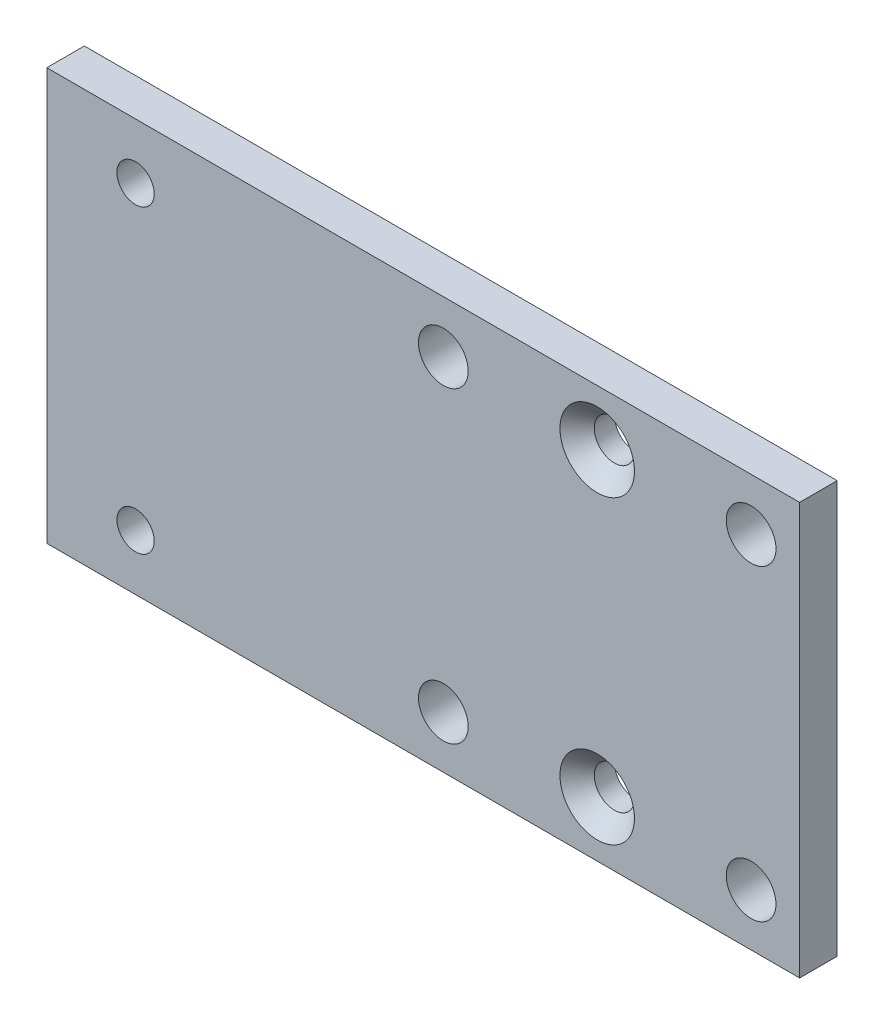
ISO-10303-21;
HEADER;
FILE_DESCRIPTION(('STEP AP214'),'2;1');
FILE_NAME('part.step','',(''),(''),'','','');
FILE_SCHEMA(('AUTOMOTIVE_DESIGN { 1 0 10303 214 1 1 1 1 }'));
ENDSEC;
DATA;
#1=APPLICATION_CONTEXT('core data for automotive mechanical design processes');
#2=APPLICATION_PROTOCOL_DEFINITION('international standard','automotive_design',2000,#1);
#3=PRODUCT_CONTEXT('',#1,'mechanical');
#4=PRODUCT('Part','Part','',(#3));
#5=PRODUCT_RELATED_PRODUCT_CATEGORY('part','',(#4));
#6=PRODUCT_DEFINITION_FORMATION('','',#4);
#7=PRODUCT_DEFINITION_CONTEXT('part definition',#1,'design');
#8=PRODUCT_DEFINITION('design','',#6,#7);
#9=PRODUCT_DEFINITION_SHAPE('','',#8);
#10=(LENGTH_UNIT() NAMED_UNIT(*) SI_UNIT(.MILLI.,.METRE.));
#11=(NAMED_UNIT(*) PLANE_ANGLE_UNIT() SI_UNIT($,.RADIAN.));
#12=(NAMED_UNIT(*) SI_UNIT($,.STERADIAN.) SOLID_ANGLE_UNIT());
#13=UNCERTAINTY_MEASURE_WITH_UNIT(LENGTH_MEASURE(1.E-05),#10,'distance_accuracy_value','');
#14=(GEOMETRIC_REPRESENTATION_CONTEXT(3) GLOBAL_UNCERTAINTY_ASSIGNED_CONTEXT((#13)) GLOBAL_UNIT_ASSIGNED_CONTEXT((#10,
#11,#12)) REPRESENTATION_CONTEXT('',''));
#15=CARTESIAN_POINT('',(0.,0.,0.));
#16=DIRECTION('',(0.,0.,1.));
#17=DIRECTION('',(1.,0.,0.));
#18=AXIS2_PLACEMENT_3D('',#15,#16,#17);
#19=CARTESIAN_POINT('',(31.8,-17.4,3.175));
#20=DIRECTION('',(-1.,0.,0.));
#21=DIRECTION('',(0.,0.,1.));
#22=AXIS2_PLACEMENT_3D('',#19,#20,#21);
#23=PLANE('',#22);
#24=DIRECTION('',(0.,1.,0.));
#25=VECTOR('',#24,1.);
#26=CARTESIAN_POINT('',(31.8,-17.4,0.));
#27=LINE('',#26,#25);
#28=CARTESIAN_POINT('',(31.8,-17.4,0.));
#29=VERTEX_POINT('',#28);
#30=CARTESIAN_POINT('',(31.8,17.4,0.));
#31=VERTEX_POINT('',#30);
#32=EDGE_CURVE('E98',#29,#31,#27,.T.);
#33=ORIENTED_EDGE('',*,*,#32,.T.);
#34=DIRECTION('',(0.,0.,-1.));
#35=VECTOR('',#34,1.);
#36=CARTESIAN_POINT('',(31.8,17.4,3.175));
#37=LINE('',#36,#35);
#38=CARTESIAN_POINT('',(31.8,17.4,3.175));
#39=VERTEX_POINT('',#38);
#40=EDGE_CURVE('E11',#39,#31,#37,.T.);
#41=ORIENTED_EDGE('',*,*,#40,.F.);
#42=DIRECTION('',(0.,1.,0.));
#43=VECTOR('',#42,1.);
#44=CARTESIAN_POINT('',(31.8,-17.4,3.175));
#45=LINE('',#44,#43);
#46=CARTESIAN_POINT('',(31.8,-17.4,3.175));
#47=VERTEX_POINT('',#46);
#48=EDGE_CURVE('E86',#47,#39,#45,.T.);
#49=ORIENTED_EDGE('',*,*,#48,.F.);
#50=DIRECTION('',(0.,0.,-1.));
#51=VECTOR('',#50,1.);
#52=CARTESIAN_POINT('',(31.8,-17.4,3.175));
#53=LINE('',#52,#51);
#54=EDGE_CURVE('E94',#47,#29,#53,.T.);
#55=ORIENTED_EDGE('',*,*,#54,.T.);
#56=EDGE_LOOP('',(#33,#41,#49,#55));
#57=FACE_BOUND('',#56,.T.);
#58=ADVANCED_FACE('F35',(#57),#23,.F.);
#59=CARTESIAN_POINT('',(-31.8,17.4,3.175));
#60=DIRECTION('',(0.,-1.,0.));
#61=DIRECTION('',(0.,0.,-1.));
#62=AXIS2_PLACEMENT_3D('',#59,#60,#61);
#63=PLANE('',#62);
#64=DIRECTION('',(-1.,0.,0.));
#65=VECTOR('',#64,1.);
#66=CARTESIAN_POINT('',(-31.8,17.4,0.));
#67=LINE('',#66,#65);
#68=CARTESIAN_POINT('',(-31.8,17.4,0.));
#69=VERTEX_POINT('',#68);
#70=EDGE_CURVE('E90',#31,#69,#67,.T.);
#71=ORIENTED_EDGE('',*,*,#70,.T.);
#72=DIRECTION('',(0.,0.,-1.));
#73=VECTOR('',#72,1.);
#74=CARTESIAN_POINT('',(-31.8,17.4,3.175));
#75=LINE('',#74,#73);
#76=CARTESIAN_POINT('',(-31.8,17.4,3.175));
#77=VERTEX_POINT('',#76);
#78=EDGE_CURVE('E43',#77,#69,#75,.T.);
#79=ORIENTED_EDGE('',*,*,#78,.F.);
#80=DIRECTION('',(-1.,0.,0.));
#81=VECTOR('',#80,1.);
#82=CARTESIAN_POINT('',(-31.8,17.4,3.175));
#83=LINE('',#82,#81);
#84=EDGE_CURVE('E81',#39,#77,#83,.T.);
#85=ORIENTED_EDGE('',*,*,#84,.F.);
#86=ORIENTED_EDGE('',*,*,#40,.T.);
#87=EDGE_LOOP('',(#71,#79,#85,#86));
#88=FACE_BOUND('',#87,.T.);
#89=ADVANCED_FACE('F89',(#88),#63,.F.);
#90=CARTESIAN_POINT('',(-31.8,-17.4,3.175));
#91=DIRECTION('',(1.,0.,0.));
#92=DIRECTION('',(0.,0.,-1.));
#93=AXIS2_PLACEMENT_3D('',#90,#91,#92);
#94=PLANE('',#93);
#95=DIRECTION('',(0.,-1.,0.));
#96=VECTOR('',#95,1.);
#97=CARTESIAN_POINT('',(-31.8,-17.4,0.));
#98=LINE('',#97,#96);
#99=CARTESIAN_POINT('',(-31.8,-17.4,0.));
#100=VERTEX_POINT('',#99);
#101=EDGE_CURVE('E68',#69,#100,#98,.T.);
#102=ORIENTED_EDGE('',*,*,#101,.T.);
#103=DIRECTION('',(0.,0.,-1.));
#104=VECTOR('',#103,1.);
#105=CARTESIAN_POINT('',(-31.8,-17.4,3.175));
#106=LINE('',#105,#104);
#107=CARTESIAN_POINT('',(-31.8,-17.4,3.175));
#108=VERTEX_POINT('',#107);
#109=EDGE_CURVE('E91',#108,#100,#106,.T.);
#110=ORIENTED_EDGE('',*,*,#109,.F.);
#111=DIRECTION('',(0.,-1.,0.));
#112=VECTOR('',#111,1.);
#113=CARTESIAN_POINT('',(-31.8,-17.4,3.175));
#114=LINE('',#113,#112);
#115=EDGE_CURVE('E84',#77,#108,#114,.T.);
#116=ORIENTED_EDGE('',*,*,#115,.F.);
#117=ORIENTED_EDGE('',*,*,#78,.T.);
#118=EDGE_LOOP('',(#102,#110,#116,#117));
#119=FACE_BOUND('',#118,.T.);
#120=ADVANCED_FACE('F92',(#119),#94,.F.);
#121=CARTESIAN_POINT('',(-31.8,-17.4,3.175));
#122=DIRECTION('',(0.,1.,0.));
#123=DIRECTION('',(0.,0.,1.));
#124=AXIS2_PLACEMENT_3D('',#121,#122,#123);
#125=PLANE('',#124);
#126=DIRECTION('',(1.,0.,0.));
#127=VECTOR('',#126,1.);
#128=CARTESIAN_POINT('',(-31.8,-17.4,0.));
#129=LINE('',#128,#127);
#130=EDGE_CURVE('E74',#100,#29,#129,.T.);
#131=ORIENTED_EDGE('',*,*,#130,.T.);
#132=ORIENTED_EDGE('',*,*,#54,.F.);
#133=DIRECTION('',(1.,0.,0.));
#134=VECTOR('',#133,1.);
#135=CARTESIAN_POINT('',(-31.8,-17.4,3.175));
#136=LINE('',#135,#134);
#137=EDGE_CURVE('E51',#108,#47,#136,.T.);
#138=ORIENTED_EDGE('',*,*,#137,.F.);
#139=ORIENTED_EDGE('',*,*,#109,.T.);
#140=EDGE_LOOP('',(#131,#132,#138,#139));
#141=FACE_BOUND('',#140,.T.);
#142=ADVANCED_FACE('F106',(#141),#125,.F.);
#143=CARTESIAN_POINT('',(0.,0.,3.175));
#144=DIRECTION('',(0.,0.,-1.));
#145=DIRECTION('',(-1.,0.,0.));
#146=AXIS2_PLACEMENT_3D('',#143,#144,#145);
#147=PLANE('',#146);
#148=CARTESIAN_POINT('',(1.7,-13.,3.175));
#149=DIRECTION('',(0.,0.,1.));
#150=DIRECTION('',(1.,0.,0.));
#151=AXIS2_PLACEMENT_3D('',#148,#149,#150);
#152=CIRCLE('',#151,2.1);
#153=CARTESIAN_POINT('',(3.8,-13.,3.175));
#154=VERTEX_POINT('',#153);
#155=EDGE_CURVE('E160',#154,#154,#152,.T.);
#156=ORIENTED_EDGE('',*,*,#155,.F.);
#157=EDGE_LOOP('',(#156));
#158=FACE_BOUND('',#157,.T.);
#159=CARTESIAN_POINT('',(27.7,-13.,3.175));
#160=DIRECTION('',(0.,0.,1.));
#161=DIRECTION('',(1.,0.,0.));
#162=AXIS2_PLACEMENT_3D('',#159,#160,#161);
#163=CIRCLE('',#162,2.1);
#164=CARTESIAN_POINT('',(29.8,-13.,3.175));
#165=VERTEX_POINT('',#164);
#166=EDGE_CURVE('E154',#165,#165,#163,.T.);
#167=ORIENTED_EDGE('',*,*,#166,.F.);
#168=EDGE_LOOP('',(#167));
#169=FACE_BOUND('',#168,.T.);
#170=CARTESIAN_POINT('',(27.7,13.,3.175));
#171=DIRECTION('',(0.,0.,1.));
#172=DIRECTION('',(1.,0.,0.));
#173=AXIS2_PLACEMENT_3D('',#170,#171,#172);
#174=CIRCLE('',#173,2.1);
#175=CARTESIAN_POINT('',(29.8,13.,3.175));
#176=VERTEX_POINT('',#175);
#177=EDGE_CURVE('E148',#176,#176,#174,.T.);
#178=ORIENTED_EDGE('',*,*,#177,.F.);
#179=EDGE_LOOP('',(#178));
#180=FACE_BOUND('',#179,.T.);
#181=CARTESIAN_POINT('',(1.7,13.,3.175));
#182=DIRECTION('',(0.,0.,1.));
#183=DIRECTION('',(1.,0.,0.));
#184=AXIS2_PLACEMENT_3D('',#181,#182,#183);
#185=CIRCLE('',#184,2.1);
#186=CARTESIAN_POINT('',(3.8,13.,3.175));
#187=VERTEX_POINT('',#186);
#188=EDGE_CURVE('E142',#187,#187,#185,.T.);
#189=ORIENTED_EDGE('',*,*,#188,.F.);
#190=EDGE_LOOP('',(#189));
#191=FACE_BOUND('',#190,.T.);
#192=CARTESIAN_POINT('',(14.7,12.7,3.175));
#193=DIRECTION('',(0.,0.,1.));
#194=DIRECTION('',(1.,0.,0.));
#195=AXIS2_PLACEMENT_3D('',#192,#193,#194);
#196=CIRCLE('',#195,3.15);
#197=CARTESIAN_POINT('',(17.85,12.7,3.175));
#198=VERTEX_POINT('',#197);
#199=EDGE_CURVE('E138',#198,#198,#196,.T.);
#200=ORIENTED_EDGE('',*,*,#199,.F.);
#201=EDGE_LOOP('',(#200));
#202=FACE_BOUND('',#201,.T.);
#203=CARTESIAN_POINT('',(14.7,-12.7,3.175));
#204=DIRECTION('',(0.,0.,1.));
#205=DIRECTION('',(1.,0.,0.));
#206=AXIS2_PLACEMENT_3D('',#203,#204,#205);
#207=CIRCLE('',#206,3.15);
#208=CARTESIAN_POINT('',(17.85,-12.7,3.175));
#209=VERTEX_POINT('',#208);
#210=EDGE_CURVE('E129',#209,#209,#207,.T.);
#211=ORIENTED_EDGE('',*,*,#210,.F.);
#212=EDGE_LOOP('',(#211));
#213=FACE_BOUND('',#212,.T.);
#214=CARTESIAN_POINT('',(-24.3,-12.7,3.175));
#215=DIRECTION('',(0.,0.,1.));
#216=DIRECTION('',(1.,0.,0.));
#217=AXIS2_PLACEMENT_3D('',#214,#215,#216);
#218=CIRCLE('',#217,1.575);
#219=CARTESIAN_POINT('',(-22.725,-12.7,3.175));
#220=VERTEX_POINT('',#219);
#221=EDGE_CURVE('E118',#220,#220,#218,.T.);
#222=ORIENTED_EDGE('',*,*,#221,.F.);
#223=EDGE_LOOP('',(#222));
#224=FACE_BOUND('',#223,.T.);
#225=CARTESIAN_POINT('',(-24.3,12.7,3.175));
#226=DIRECTION('',(0.,0.,1.));
#227=DIRECTION('',(1.,0.,0.));
#228=AXIS2_PLACEMENT_3D('',#225,#226,#227);
#229=CIRCLE('',#228,1.575);
#230=CARTESIAN_POINT('',(-22.725,12.7,3.175));
#231=VERTEX_POINT('',#230);
#232=EDGE_CURVE('E112',#231,#231,#229,.T.);
#233=ORIENTED_EDGE('',*,*,#232,.F.);
#234=EDGE_LOOP('',(#233));
#235=FACE_BOUND('',#234,.T.);
#236=ORIENTED_EDGE('',*,*,#48,.T.);
#237=ORIENTED_EDGE('',*,*,#84,.T.);
#238=ORIENTED_EDGE('',*,*,#115,.T.);
#239=ORIENTED_EDGE('',*,*,#137,.T.);
#240=EDGE_LOOP('',(#236,#237,#238,#239));
#241=FACE_BOUND('',#240,.T.);
#242=ADVANCED_FACE('F82',(#158,#169,#180,#191,#202,#213,#224,#235,#241),#147,.F.);
#243=CARTESIAN_POINT('',(0.,0.,0.));
#244=DIRECTION('',(0.,0.,-1.));
#245=DIRECTION('',(-1.,0.,0.));
#246=AXIS2_PLACEMENT_3D('',#243,#244,#245);
#247=PLANE('',#246);
#248=CARTESIAN_POINT('',(1.7,-13.,0.));
#249=DIRECTION('',(0.,0.,1.));
#250=DIRECTION('',(1.,0.,0.));
#251=AXIS2_PLACEMENT_3D('',#248,#249,#250);
#252=CIRCLE('',#251,2.1);
#253=CARTESIAN_POINT('',(3.8,-13.,0.));
#254=VERTEX_POINT('',#253);
#255=EDGE_CURVE('E157',#254,#254,#252,.T.);
#256=ORIENTED_EDGE('',*,*,#255,.T.);
#257=EDGE_LOOP('',(#256));
#258=FACE_BOUND('',#257,.T.);
#259=CARTESIAN_POINT('',(27.7,-13.,0.));
#260=DIRECTION('',(0.,0.,1.));
#261=DIRECTION('',(1.,0.,0.));
#262=AXIS2_PLACEMENT_3D('',#259,#260,#261);
#263=CIRCLE('',#262,2.1);
#264=CARTESIAN_POINT('',(29.8,-13.,0.));
#265=VERTEX_POINT('',#264);
#266=EDGE_CURVE('E151',#265,#265,#263,.T.);
#267=ORIENTED_EDGE('',*,*,#266,.T.);
#268=EDGE_LOOP('',(#267));
#269=FACE_BOUND('',#268,.T.);
#270=CARTESIAN_POINT('',(27.7,13.,0.));
#271=DIRECTION('',(0.,0.,1.));
#272=DIRECTION('',(1.,0.,0.));
#273=AXIS2_PLACEMENT_3D('',#270,#271,#272);
#274=CIRCLE('',#273,2.1);
#275=CARTESIAN_POINT('',(29.8,13.,0.));
#276=VERTEX_POINT('',#275);
#277=EDGE_CURVE('E145',#276,#276,#274,.T.);
#278=ORIENTED_EDGE('',*,*,#277,.T.);
#279=EDGE_LOOP('',(#278));
#280=FACE_BOUND('',#279,.T.);
#281=CARTESIAN_POINT('',(1.7,13.,0.));
#282=DIRECTION('',(0.,0.,1.));
#283=DIRECTION('',(1.,0.,0.));
#284=AXIS2_PLACEMENT_3D('',#281,#282,#283);
#285=CIRCLE('',#284,2.1);
#286=CARTESIAN_POINT('',(3.8,13.,0.));
#287=VERTEX_POINT('',#286);
#288=EDGE_CURVE('E141',#287,#287,#285,.T.);
#289=ORIENTED_EDGE('',*,*,#288,.T.);
#290=EDGE_LOOP('',(#289));
#291=FACE_BOUND('',#290,.T.);
#292=CARTESIAN_POINT('',(14.7,12.7,0.));
#293=DIRECTION('',(0.,0.,1.));
#294=DIRECTION('',(1.,0.,0.));
#295=AXIS2_PLACEMENT_3D('',#292,#293,#294);
#296=CIRCLE('',#295,1.7);
#297=CARTESIAN_POINT('',(16.4,12.7,0.));
#298=VERTEX_POINT('',#297);
#299=EDGE_CURVE('E132',#298,#298,#296,.T.);
#300=ORIENTED_EDGE('',*,*,#299,.T.);
#301=EDGE_LOOP('',(#300));
#302=FACE_BOUND('',#301,.T.);
#303=CARTESIAN_POINT('',(14.7,-12.7,0.));
#304=DIRECTION('',(0.,0.,1.));
#305=DIRECTION('',(1.,0.,0.));
#306=AXIS2_PLACEMENT_3D('',#303,#304,#305);
#307=CIRCLE('',#306,1.7);
#308=CARTESIAN_POINT('',(16.4,-12.7,0.));
#309=VERTEX_POINT('',#308);
#310=EDGE_CURVE('E121',#309,#309,#307,.T.);
#311=ORIENTED_EDGE('',*,*,#310,.T.);
#312=EDGE_LOOP('',(#311));
#313=FACE_BOUND('',#312,.T.);
#314=CARTESIAN_POINT('',(-24.3,-12.7,0.));
#315=DIRECTION('',(0.,0.,1.));
#316=DIRECTION('',(1.,0.,0.));
#317=AXIS2_PLACEMENT_3D('',#314,#315,#316);
#318=CIRCLE('',#317,1.575);
#319=CARTESIAN_POINT('',(-22.725,-12.7,0.));
#320=VERTEX_POINT('',#319);
#321=EDGE_CURVE('E115',#320,#320,#318,.T.);
#322=ORIENTED_EDGE('',*,*,#321,.T.);
#323=EDGE_LOOP('',(#322));
#324=FACE_BOUND('',#323,.T.);
#325=CARTESIAN_POINT('',(-24.3,12.7,0.));
#326=DIRECTION('',(0.,0.,1.));
#327=DIRECTION('',(1.,0.,0.));
#328=AXIS2_PLACEMENT_3D('',#325,#326,#327);
#329=CIRCLE('',#328,1.575);
#330=CARTESIAN_POINT('',(-22.725,12.7,0.));
#331=VERTEX_POINT('',#330);
#332=EDGE_CURVE('E101',#331,#331,#329,.T.);
#333=ORIENTED_EDGE('',*,*,#332,.T.);
#334=EDGE_LOOP('',(#333));
#335=FACE_BOUND('',#334,.T.);
#336=ORIENTED_EDGE('',*,*,#32,.F.);
#337=ORIENTED_EDGE('',*,*,#130,.F.);
#338=ORIENTED_EDGE('',*,*,#101,.F.);
#339=ORIENTED_EDGE('',*,*,#70,.F.);
#340=EDGE_LOOP('',(#336,#337,#338,#339));
#341=FACE_BOUND('',#340,.T.);
#342=ADVANCED_FACE('F109',(#258,#269,#280,#291,#302,#313,#324,#335,#341),#247,.T.);
#343=CARTESIAN_POINT('',(-24.3,12.7,0.));
#344=DIRECTION('',(0.,0.,1.));
#345=DIRECTION('',(1.,0.,0.));
#346=AXIS2_PLACEMENT_3D('',#343,#344,#345);
#347=CYLINDRICAL_SURFACE('',#346,1.575);
#348=ORIENTED_EDGE('',*,*,#332,.F.);
#349=EDGE_LOOP('',(#348));
#350=FACE_BOUND('',#349,.T.);
#351=ORIENTED_EDGE('',*,*,#232,.T.);
#352=EDGE_LOOP('',(#351));
#353=FACE_BOUND('',#352,.T.);
#354=ADVANCED_FACE('F192',(#350,#353),#347,.F.);
#355=CARTESIAN_POINT('',(-24.3,-12.7,0.));
#356=DIRECTION('',(0.,0.,1.));
#357=DIRECTION('',(1.,0.,0.));
#358=AXIS2_PLACEMENT_3D('',#355,#356,#357);
#359=CYLINDRICAL_SURFACE('',#358,1.575);
#360=ORIENTED_EDGE('',*,*,#321,.F.);
#361=EDGE_LOOP('',(#360));
#362=FACE_BOUND('',#361,.T.);
#363=ORIENTED_EDGE('',*,*,#221,.T.);
#364=EDGE_LOOP('',(#363));
#365=FACE_BOUND('',#364,.T.);
#366=ADVANCED_FACE('F194',(#362,#365),#359,.F.);
#367=CARTESIAN_POINT('',(14.7,-12.7,3.175));
#368=DIRECTION('',(0.,0.,1.));
#369=DIRECTION('',(1.,0.,0.));
#370=AXIS2_PLACEMENT_3D('',#367,#368,#369);
#371=CYLINDRICAL_SURFACE('',#370,1.7);
#372=ORIENTED_EDGE('',*,*,#310,.F.);
#373=EDGE_LOOP('',(#372));
#374=FACE_BOUND('',#373,.T.);
#375=CARTESIAN_POINT('',(14.7,-12.7,1.725));
#376=DIRECTION('',(0.,0.,1.));
#377=DIRECTION('',(1.,0.,0.));
#378=AXIS2_PLACEMENT_3D('',#375,#376,#377);
#379=CIRCLE('',#378,1.7);
#380=CARTESIAN_POINT('',(16.4,-12.7,1.725));
#381=VERTEX_POINT('',#380);
#382=EDGE_CURVE('E126',#381,#381,#379,.T.);
#383=ORIENTED_EDGE('',*,*,#382,.T.);
#384=EDGE_LOOP('',(#383));
#385=FACE_BOUND('',#384,.T.);
#386=ADVANCED_FACE('F201',(#374,#385),#371,.F.);
#387=CARTESIAN_POINT('',(14.7,-12.7,3.175));
#388=DIRECTION('',(0.,0.,1.));
#389=DIRECTION('',(1.,0.,0.));
#390=AXIS2_PLACEMENT_3D('',#387,#388,#389);
#391=CONICAL_SURFACE('',#390,3.15,0.785398163397447);
#392=ORIENTED_EDGE('',*,*,#382,.F.);
#393=EDGE_LOOP('',(#392));
#394=FACE_BOUND('',#393,.T.);
#395=ORIENTED_EDGE('',*,*,#210,.T.);
#396=EDGE_LOOP('',(#395));
#397=FACE_BOUND('',#396,.T.);
#398=ADVANCED_FACE('F280',(#394,#397),#391,.F.);
#399=CARTESIAN_POINT('',(14.7,12.7,3.175));
#400=DIRECTION('',(0.,0.,1.));
#401=DIRECTION('',(1.,0.,0.));
#402=AXIS2_PLACEMENT_3D('',#399,#400,#401);
#403=CYLINDRICAL_SURFACE('',#402,1.7);
#404=ORIENTED_EDGE('',*,*,#299,.F.);
#405=EDGE_LOOP('',(#404));
#406=FACE_BOUND('',#405,.T.);
#407=CARTESIAN_POINT('',(14.7,12.7,1.725));
#408=DIRECTION('',(0.,0.,1.));
#409=DIRECTION('',(1.,0.,0.));
#410=AXIS2_PLACEMENT_3D('',#407,#408,#409);
#411=CIRCLE('',#410,1.7);
#412=CARTESIAN_POINT('',(16.4,12.7,1.725));
#413=VERTEX_POINT('',#412);
#414=EDGE_CURVE('E135',#413,#413,#411,.T.);
#415=ORIENTED_EDGE('',*,*,#414,.T.);
#416=EDGE_LOOP('',(#415));
#417=FACE_BOUND('',#416,.T.);
#418=ADVANCED_FACE('F276',(#406,#417),#403,.F.);
#419=CARTESIAN_POINT('',(14.7,12.7,3.175));
#420=DIRECTION('',(0.,0.,1.));
#421=DIRECTION('',(1.,0.,0.));
#422=AXIS2_PLACEMENT_3D('',#419,#420,#421);
#423=CONICAL_SURFACE('',#422,3.15,0.785398163397447);
#424=ORIENTED_EDGE('',*,*,#414,.F.);
#425=EDGE_LOOP('',(#424));
#426=FACE_BOUND('',#425,.T.);
#427=ORIENTED_EDGE('',*,*,#199,.T.);
#428=EDGE_LOOP('',(#427));
#429=FACE_BOUND('',#428,.T.);
#430=ADVANCED_FACE('F241',(#426,#429),#423,.F.);
#431=CARTESIAN_POINT('',(1.7,13.,0.));
#432=DIRECTION('',(0.,0.,1.));
#433=DIRECTION('',(1.,0.,0.));
#434=AXIS2_PLACEMENT_3D('',#431,#432,#433);
#435=CYLINDRICAL_SURFACE('',#434,2.1);
#436=ORIENTED_EDGE('',*,*,#288,.F.);
#437=EDGE_LOOP('',(#436));
#438=FACE_BOUND('',#437,.T.);
#439=ORIENTED_EDGE('',*,*,#188,.T.);
#440=EDGE_LOOP('',(#439));
#441=FACE_BOUND('',#440,.T.);
#442=ADVANCED_FACE('F235',(#438,#441),#435,.F.);
#443=CARTESIAN_POINT('',(27.7,13.,0.));
#444=DIRECTION('',(0.,0.,1.));
#445=DIRECTION('',(1.,0.,0.));
#446=AXIS2_PLACEMENT_3D('',#443,#444,#445);
#447=CYLINDRICAL_SURFACE('',#446,2.1);
#448=ORIENTED_EDGE('',*,*,#277,.F.);
#449=EDGE_LOOP('',(#448));
#450=FACE_BOUND('',#449,.T.);
#451=ORIENTED_EDGE('',*,*,#177,.T.);
#452=EDGE_LOOP('',(#451));
#453=FACE_BOUND('',#452,.T.);
#454=ADVANCED_FACE('F240',(#450,#453),#447,.F.);
#455=CARTESIAN_POINT('',(27.7,-13.,0.));
#456=DIRECTION('',(0.,0.,1.));
#457=DIRECTION('',(1.,0.,0.));
#458=AXIS2_PLACEMENT_3D('',#455,#456,#457);
#459=CYLINDRICAL_SURFACE('',#458,2.1);
#460=ORIENTED_EDGE('',*,*,#266,.F.);
#461=EDGE_LOOP('',(#460));
#462=FACE_BOUND('',#461,.T.);
#463=ORIENTED_EDGE('',*,*,#166,.T.);
#464=EDGE_LOOP('',(#463));
#465=FACE_BOUND('',#464,.T.);
#466=ADVANCED_FACE('F171',(#462,#465),#459,.F.);
#467=CARTESIAN_POINT('',(1.7,-13.,0.));
#468=DIRECTION('',(0.,0.,1.));
#469=DIRECTION('',(1.,0.,0.));
#470=AXIS2_PLACEMENT_3D('',#467,#468,#469);
#471=CYLINDRICAL_SURFACE('',#470,2.1);
#472=ORIENTED_EDGE('',*,*,#255,.F.);
#473=EDGE_LOOP('',(#472));
#474=FACE_BOUND('',#473,.T.);
#475=ORIENTED_EDGE('',*,*,#155,.T.);
#476=EDGE_LOOP('',(#475));
#477=FACE_BOUND('',#476,.T.);
#478=ADVANCED_FACE('F168',(#474,#477),#471,.F.);
#479=CLOSED_SHELL('',(#58,#89,#120,#142,#242,#342,#354,#366,#386,#398,#418,#430,#442,#454,#466,#478));
#480=MANIFOLD_SOLID_BREP('B2',#479);
#481=ADVANCED_BREP_SHAPE_REPRESENTATION('',(#18,#480),#14);
#482=SHAPE_DEFINITION_REPRESENTATION(#9,#481);
ENDSEC;
END-ISO-10303-21;
